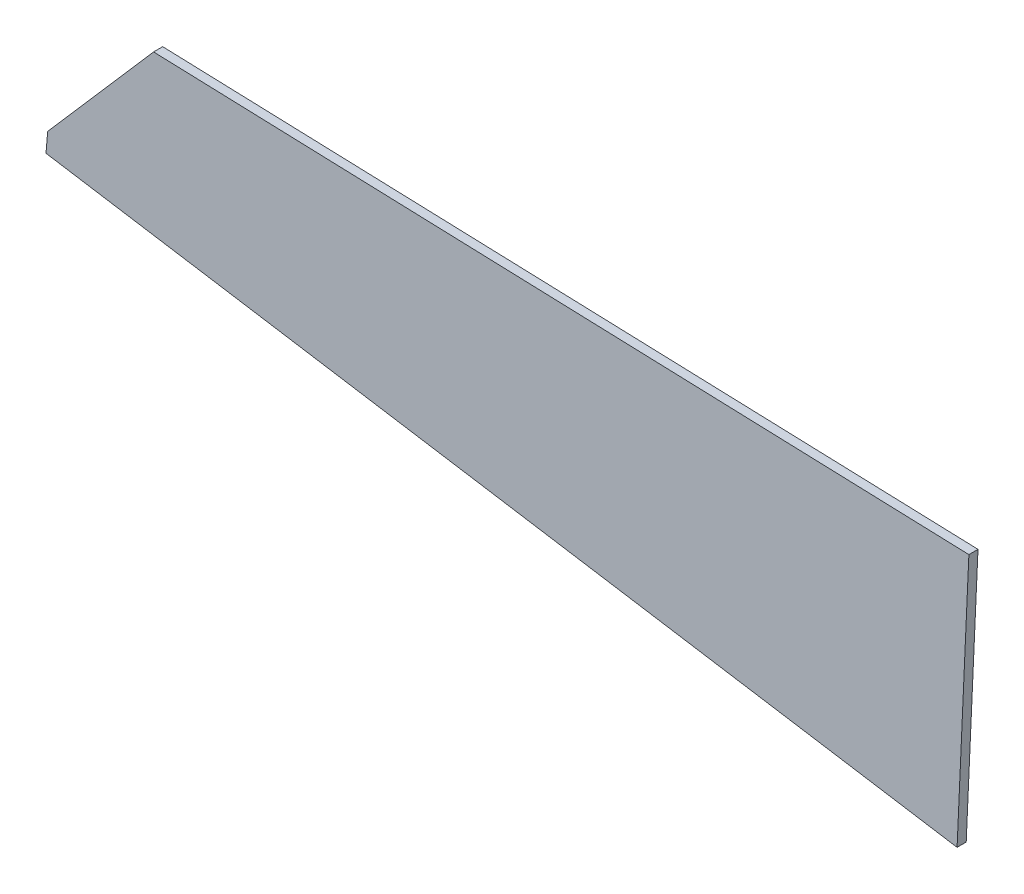
ISO-10303-21;
HEADER;
FILE_DESCRIPTION(('STEP AP214'),'2;1');
FILE_NAME('part.step','',(''),(''),'','','');
FILE_SCHEMA(('AUTOMOTIVE_DESIGN { 1 0 10303 214 1 1 1 1 }'));
ENDSEC;
DATA;
#1=APPLICATION_CONTEXT('core data for automotive mechanical design processes');
#2=APPLICATION_PROTOCOL_DEFINITION('international standard','automotive_design',2000,#1);
#3=PRODUCT_CONTEXT('',#1,'mechanical');
#4=PRODUCT('Part','Part','',(#3));
#5=PRODUCT_RELATED_PRODUCT_CATEGORY('part','',(#4));
#6=PRODUCT_DEFINITION_FORMATION('','',#4);
#7=PRODUCT_DEFINITION_CONTEXT('part definition',#1,'design');
#8=PRODUCT_DEFINITION('design','',#6,#7);
#9=PRODUCT_DEFINITION_SHAPE('','',#8);
#10=(LENGTH_UNIT() NAMED_UNIT(*) SI_UNIT(.MILLI.,.METRE.));
#11=(NAMED_UNIT(*) PLANE_ANGLE_UNIT() SI_UNIT($,.RADIAN.));
#12=(NAMED_UNIT(*) SI_UNIT($,.STERADIAN.) SOLID_ANGLE_UNIT());
#13=UNCERTAINTY_MEASURE_WITH_UNIT(LENGTH_MEASURE(1.E-05),#10,'distance_accuracy_value','');
#14=(GEOMETRIC_REPRESENTATION_CONTEXT(3) GLOBAL_UNCERTAINTY_ASSIGNED_CONTEXT((#13)) GLOBAL_UNIT_ASSIGNED_CONTEXT((#10,
#11,#12)) REPRESENTATION_CONTEXT('',''));
#15=CARTESIAN_POINT('',(0.,0.,0.));
#16=DIRECTION('',(0.,0.,1.));
#17=DIRECTION('',(1.,0.,0.));
#18=AXIS2_PLACEMENT_3D('',#15,#16,#17);
#19=CARTESIAN_POINT('',(479.882070141573,-4.33837006876913,3.));
#20=DIRECTION('',(-0.998966921261033,0.0454432638160364,0.));
#21=DIRECTION('',(-0.0454432638160364,-0.998966921261033,0.));
#22=AXIS2_PLACEMENT_3D('',#19,#20,#21);
#23=PLANE('',#22);
#24=DIRECTION('',(0.0454432638160364,0.998966921261033,0.));
#25=VECTOR('',#24,1.);
#26=CARTESIAN_POINT('',(479.882070141573,-4.33837006876913,0.));
#27=LINE('',#26,#25);
#28=CARTESIAN_POINT('',(479.882070141573,-4.33837006876913,0.));
#29=VERTEX_POINT('',#28);
#30=CARTESIAN_POINT('',(483.765805082814,81.0367199104826,0.));
#31=VERTEX_POINT('',#30);
#32=EDGE_CURVE('E107',#29,#31,#27,.T.);
#33=ORIENTED_EDGE('',*,*,#32,.T.);
#34=DIRECTION('',(0.,0.,-1.));
#35=VECTOR('',#34,1.);
#36=CARTESIAN_POINT('',(483.765805082814,81.0367199104826,3.));
#37=LINE('',#36,#35);
#38=CARTESIAN_POINT('',(483.765805082814,81.0367199104826,3.));
#39=VERTEX_POINT('',#38);
#40=EDGE_CURVE('E11',#39,#31,#37,.T.);
#41=ORIENTED_EDGE('',*,*,#40,.F.);
#42=DIRECTION('',(0.0454432638160364,0.998966921261033,0.));
#43=VECTOR('',#42,1.);
#44=CARTESIAN_POINT('',(479.882070141573,-4.33837006876913,3.));
#45=LINE('',#44,#43);
#46=CARTESIAN_POINT('',(479.882070141573,-4.33837006876913,3.));
#47=VERTEX_POINT('',#46);
#48=EDGE_CURVE('E115',#47,#39,#45,.T.);
#49=ORIENTED_EDGE('',*,*,#48,.F.);
#50=DIRECTION('',(0.,0.,-1.));
#51=VECTOR('',#50,1.);
#52=CARTESIAN_POINT('',(479.882070141573,-4.33837006876913,3.));
#53=LINE('',#52,#51);
#54=EDGE_CURVE('E103',#47,#29,#53,.T.);
#55=ORIENTED_EDGE('',*,*,#54,.T.);
#56=EDGE_LOOP('',(#33,#41,#49,#55));
#57=FACE_BOUND('',#56,.T.);
#58=ADVANCED_FACE('F33',(#57),#23,.F.);
#59=CARTESIAN_POINT('',(215.474767364422,90.1482420878978,3.));
#60=DIRECTION('',(-0.0339417682633904,-0.99942381218738,0.));
#61=DIRECTION('',(0.99942381218738,-0.0339417682633904,0.));
#62=AXIS2_PLACEMENT_3D('',#59,#60,#61);
#63=PLANE('',#62);
#64=DIRECTION('',(-0.999423812187379,0.0339417682633904,0.));
#65=VECTOR('',#64,1.);
#66=CARTESIAN_POINT('',(215.474767364422,90.1482420878978,0.));
#67=LINE('',#66,#65);
#68=CARTESIAN_POINT('',(215.474767364422,90.1482420878978,0.));
#69=VERTEX_POINT('',#68);
#70=EDGE_CURVE('E110',#31,#69,#67,.T.);
#71=ORIENTED_EDGE('',*,*,#70,.T.);
#72=DIRECTION('',(0.,0.,-1.));
#73=VECTOR('',#72,1.);
#74=CARTESIAN_POINT('',(215.474767364422,90.1482420878978,3.));
#75=LINE('',#74,#73);
#76=CARTESIAN_POINT('',(215.474767364422,90.1482420878978,3.));
#77=VERTEX_POINT('',#76);
#78=EDGE_CURVE('E41',#77,#69,#75,.T.);
#79=ORIENTED_EDGE('',*,*,#78,.F.);
#80=DIRECTION('',(-0.999423812187379,0.0339417682633908,0.));
#81=VECTOR('',#80,1.);
#82=CARTESIAN_POINT('',(480.765805082814,81.1386039195971,3.));
#83=LINE('',#82,#81);
#84=EDGE_CURVE('E83',#39,#77,#83,.T.);
#85=ORIENTED_EDGE('',*,*,#84,.F.);
#86=ORIENTED_EDGE('',*,*,#40,.T.);
#87=EDGE_LOOP('',(#71,#79,#85,#86));
#88=FACE_BOUND('',#87,.T.);
#89=ADVANCED_FACE('F134',(#88),#63,.F.);
#90=CARTESIAN_POINT('',(180.640284286076,50.1054072669823,3.));
#91=DIRECTION('',(0.75446904582028,-0.656335629765013,0.));
#92=DIRECTION('',(0.656335629765013,0.75446904582028,0.));
#93=AXIS2_PLACEMENT_3D('',#90,#91,#92);
#94=PLANE('',#93);
#95=DIRECTION('',(-0.656335629765013,-0.75446904582028,0.));
#96=VECTOR('',#95,1.);
#97=CARTESIAN_POINT('',(180.640284286076,50.1054072669823,0.));
#98=LINE('',#97,#96);
#99=CARTESIAN_POINT('',(180.640284286076,50.1054072669823,0.));
#100=VERTEX_POINT('',#99);
#101=EDGE_CURVE('E98',#69,#100,#98,.T.);
#102=ORIENTED_EDGE('',*,*,#101,.T.);
#103=DIRECTION('',(0.,0.,-1.));
#104=VECTOR('',#103,1.);
#105=CARTESIAN_POINT('',(180.640284286076,50.1054072669823,3.));
#106=LINE('',#105,#104);
#107=CARTESIAN_POINT('',(180.640284286076,50.1054072669823,3.));
#108=VERTEX_POINT('',#107);
#109=EDGE_CURVE('E95',#108,#100,#106,.T.);
#110=ORIENTED_EDGE('',*,*,#109,.F.);
#111=DIRECTION('',(-0.656335629765013,-0.75446904582028,0.));
#112=VECTOR('',#111,1.);
#113=CARTESIAN_POINT('',(180.640284286076,50.1054072669823,3.));
#114=LINE('',#113,#112);
#115=EDGE_CURVE('E87',#77,#108,#114,.T.);
#116=ORIENTED_EDGE('',*,*,#115,.F.);
#117=ORIENTED_EDGE('',*,*,#78,.T.);
#118=EDGE_LOOP('',(#102,#110,#116,#117));
#119=FACE_BOUND('',#118,.T.);
#120=ADVANCED_FACE('F96',(#119),#94,.F.);
#121=CARTESIAN_POINT('',(180.640284286076,50.1054072669823,3.));
#122=DIRECTION('',(0.996331079164453,-0.0855825957248153,0.));
#123=DIRECTION('',(0.0855825957248153,0.996331079164453,0.));
#124=AXIS2_PLACEMENT_3D('',#121,#122,#123);
#125=PLANE('',#124);
#126=DIRECTION('',(-0.0855825957248153,-0.996331079164453,0.));
#127=VECTOR('',#126,1.);
#128=CARTESIAN_POINT('',(180.640284286076,50.1054072669823,0.));
#129=LINE('',#128,#127);
#130=CARTESIAN_POINT('',(180.077745423273,43.5564711485887,0.));
#131=VERTEX_POINT('',#130);
#132=EDGE_CURVE('E69',#100,#131,#129,.T.);
#133=ORIENTED_EDGE('',*,*,#132,.T.);
#134=DIRECTION('',(0.,0.,-1.));
#135=VECTOR('',#134,1.);
#136=CARTESIAN_POINT('',(180.077745423273,43.5564711485887,3.));
#137=LINE('',#136,#135);
#138=CARTESIAN_POINT('',(180.077745423273,43.5564711485887,3.));
#139=VERTEX_POINT('',#138);
#140=EDGE_CURVE('E99',#139,#131,#137,.T.);
#141=ORIENTED_EDGE('',*,*,#140,.F.);
#142=DIRECTION('',(-0.0855825957248153,-0.996331079164453,0.));
#143=VECTOR('',#142,1.);
#144=CARTESIAN_POINT('',(180.640284286076,50.1054072669823,3.));
#145=LINE('',#144,#143);
#146=EDGE_CURVE('E91',#108,#139,#145,.T.);
#147=ORIENTED_EDGE('',*,*,#146,.F.);
#148=ORIENTED_EDGE('',*,*,#109,.T.);
#149=EDGE_LOOP('',(#133,#141,#147,#148));
#150=FACE_BOUND('',#149,.T.);
#151=ADVANCED_FACE('F101',(#150),#125,.F.);
#152=CARTESIAN_POINT('',(180.077745423273,43.5564711485887,3.));
#153=DIRECTION('',(0.157753322808903,0.987478551231747,0.));
#154=DIRECTION('',(-0.987478551231747,0.157753322808903,0.));
#155=AXIS2_PLACEMENT_3D('',#152,#153,#154);
#156=PLANE('',#155);
#157=DIRECTION('',(0.987478551231747,-0.157753322808903,0.));
#158=VECTOR('',#157,1.);
#159=CARTESIAN_POINT('',(180.077745423273,43.5564711485887,0.));
#160=LINE('',#159,#158);
#161=EDGE_CURVE('E75',#131,#29,#160,.T.);
#162=ORIENTED_EDGE('',*,*,#161,.T.);
#163=ORIENTED_EDGE('',*,*,#54,.F.);
#164=DIRECTION('',(0.987478551231747,-0.157753322808903,0.));
#165=VECTOR('',#164,1.);
#166=CARTESIAN_POINT('',(180.077745423273,43.5564711485887,3.));
#167=LINE('',#166,#165);
#168=EDGE_CURVE('E49',#139,#47,#167,.T.);
#169=ORIENTED_EDGE('',*,*,#168,.F.);
#170=ORIENTED_EDGE('',*,*,#140,.T.);
#171=EDGE_LOOP('',(#162,#163,#169,#170));
#172=FACE_BOUND('',#171,.T.);
#173=ADVANCED_FACE('F123',(#172),#156,.F.);
#174=CARTESIAN_POINT('',(0.,0.,3.));
#175=DIRECTION('',(0.,0.,-1.));
#176=DIRECTION('',(-1.,0.,0.));
#177=AXIS2_PLACEMENT_3D('',#174,#175,#176);
#178=PLANE('',#177);
#179=ORIENTED_EDGE('',*,*,#48,.T.);
#180=ORIENTED_EDGE('',*,*,#84,.T.);
#181=ORIENTED_EDGE('',*,*,#115,.T.);
#182=ORIENTED_EDGE('',*,*,#146,.T.);
#183=ORIENTED_EDGE('',*,*,#168,.T.);
#184=EDGE_LOOP('',(#179,#180,#181,#182,#183));
#185=FACE_BOUND('',#184,.T.);
#186=ADVANCED_FACE('F89',(#185),#178,.F.);
#187=CARTESIAN_POINT('',(0.,0.,0.));
#188=DIRECTION('',(0.,0.,-1.));
#189=DIRECTION('',(-1.,0.,0.));
#190=AXIS2_PLACEMENT_3D('',#187,#188,#189);
#191=PLANE('',#190);
#192=ORIENTED_EDGE('',*,*,#32,.F.);
#193=ORIENTED_EDGE('',*,*,#161,.F.);
#194=ORIENTED_EDGE('',*,*,#132,.F.);
#195=ORIENTED_EDGE('',*,*,#101,.F.);
#196=ORIENTED_EDGE('',*,*,#70,.F.);
#197=EDGE_LOOP('',(#192,#193,#194,#195,#196));
#198=FACE_BOUND('',#197,.T.);
#199=ADVANCED_FACE('F119',(#198),#191,.T.);
#200=CLOSED_SHELL('',(#58,#89,#120,#151,#173,#186,#199));
#201=MANIFOLD_SOLID_BREP('B2',#200);
#202=ADVANCED_BREP_SHAPE_REPRESENTATION('',(#18,#201),#14);
#203=SHAPE_DEFINITION_REPRESENTATION(#9,#202);
ENDSEC;
END-ISO-10303-21;
